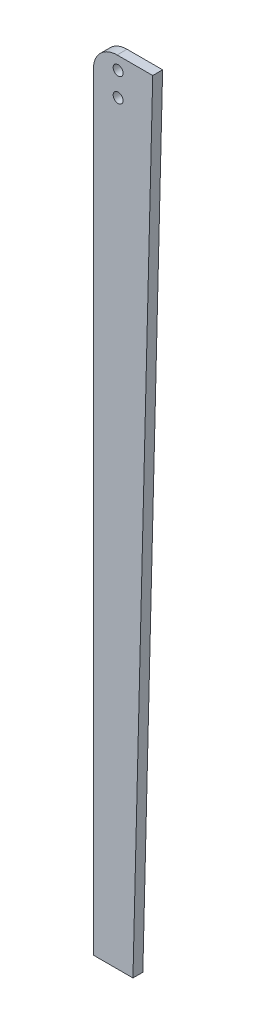
ISO-10303-21;
HEADER;
FILE_DESCRIPTION(('STEP AP214'),'2;1');
FILE_NAME('part.step','',(''),(''),'','','');
FILE_SCHEMA(('AUTOMOTIVE_DESIGN { 1 0 10303 214 1 1 1 1 }'));
ENDSEC;
DATA;
#1=APPLICATION_CONTEXT('core data for automotive mechanical design processes');
#2=APPLICATION_PROTOCOL_DEFINITION('international standard','automotive_design',2000,#1);
#3=PRODUCT_CONTEXT('',#1,'mechanical');
#4=PRODUCT('Part','Part','',(#3));
#5=PRODUCT_RELATED_PRODUCT_CATEGORY('part','',(#4));
#6=PRODUCT_DEFINITION_FORMATION('','',#4);
#7=PRODUCT_DEFINITION_CONTEXT('part definition',#1,'design');
#8=PRODUCT_DEFINITION('design','',#6,#7);
#9=PRODUCT_DEFINITION_SHAPE('','',#8);
#10=(LENGTH_UNIT() NAMED_UNIT(*) SI_UNIT(.MILLI.,.METRE.));
#11=(NAMED_UNIT(*) PLANE_ANGLE_UNIT() SI_UNIT($,.RADIAN.));
#12=(NAMED_UNIT(*) SI_UNIT($,.STERADIAN.) SOLID_ANGLE_UNIT());
#13=UNCERTAINTY_MEASURE_WITH_UNIT(LENGTH_MEASURE(1.E-05),#10,'distance_accuracy_value','');
#14=(GEOMETRIC_REPRESENTATION_CONTEXT(3) GLOBAL_UNCERTAINTY_ASSIGNED_CONTEXT((#13)) GLOBAL_UNIT_ASSIGNED_CONTEXT((#10,
#11,#12)) REPRESENTATION_CONTEXT('',''));
#15=CARTESIAN_POINT('',(0.,0.,0.));
#16=DIRECTION('',(0.,0.,1.));
#17=DIRECTION('',(1.,0.,0.));
#18=AXIS2_PLACEMENT_3D('',#15,#16,#17);
#19=CARTESIAN_POINT('',(-0.317500000000001,-3.4925,3.175));
#20=DIRECTION('',(0.,0.,1.));
#21=DIRECTION('',(1.,0.,0.));
#22=AXIS2_PLACEMENT_3D('',#19,#20,#21);
#23=PLANE('',#22);
#24=CARTESIAN_POINT('',(0.,0.,3.175));
#25=DIRECTION('',(0.,0.,1.));
#26=DIRECTION('',(1.,0.,0.));
#27=AXIS2_PLACEMENT_3D('',#24,#25,#26);
#28=CIRCLE('',#27,1.5875);
#29=CARTESIAN_POINT('',(1.5875,0.,3.175));
#30=VERTEX_POINT('',#29);
#31=EDGE_CURVE('E109',#30,#30,#28,.T.);
#32=ORIENTED_EDGE('',*,*,#31,.F.);
#33=EDGE_LOOP('',(#32));
#34=FACE_BOUND('',#33,.T.);
#35=DIRECTION('',(0.024992191160203,0.999687646408123,0.));
#36=VECTOR('',#35,1.);
#37=CARTESIAN_POINT('',(11.1125,4.1275,3.175));
#38=LINE('',#37,#36);
#39=CARTESIAN_POINT('',(4.76250000000003,-249.8725,3.175));
#40=VERTEX_POINT('',#39);
#41=CARTESIAN_POINT('',(11.1125,4.1275,3.175));
#42=VERTEX_POINT('',#41);
#43=EDGE_CURVE('E114',#40,#42,#38,.T.);
#44=ORIENTED_EDGE('',*,*,#43,.T.);
#45=DIRECTION('',(-1.,0.,0.));
#46=VECTOR('',#45,1.);
#47=CARTESIAN_POINT('',(-0.317500000000001,4.1275,3.175));
#48=LINE('',#47,#46);
#49=CARTESIAN_POINT('',(-0.317500000000002,4.1275,3.175));
#50=VERTEX_POINT('',#49);
#51=EDGE_CURVE('E81',#42,#50,#48,.T.);
#52=ORIENTED_EDGE('',*,*,#51,.T.);
#53=CARTESIAN_POINT('',(-0.317500000000001,-3.4925,3.175));
#54=DIRECTION('',(0.,0.,1.));
#55=DIRECTION('',(1.,0.,0.));
#56=AXIS2_PLACEMENT_3D('',#53,#54,#55);
#57=CIRCLE('',#56,7.62);
#58=CARTESIAN_POINT('',(-7.9375,-3.4925,3.175));
#59=VERTEX_POINT('',#58);
#60=EDGE_CURVE('E85',#50,#59,#57,.T.);
#61=ORIENTED_EDGE('',*,*,#60,.T.);
#62=DIRECTION('',(0.,-1.,0.));
#63=VECTOR('',#62,1.);
#64=CARTESIAN_POINT('',(-7.9375,-3.4925,3.175));
#65=LINE('',#64,#63);
#66=CARTESIAN_POINT('',(-7.93749999999997,-249.8725,3.175));
#67=VERTEX_POINT('',#66);
#68=EDGE_CURVE('E89',#59,#67,#65,.T.);
#69=ORIENTED_EDGE('',*,*,#68,.T.);
#70=DIRECTION('',(1.,0.,0.));
#71=VECTOR('',#70,1.);
#72=CARTESIAN_POINT('',(-7.93749999999997,-249.8725,3.175));
#73=LINE('',#72,#71);
#74=EDGE_CURVE('E47',#67,#40,#73,.T.);
#75=ORIENTED_EDGE('',*,*,#74,.T.);
#76=EDGE_LOOP('',(#44,#52,#61,#69,#75));
#77=FACE_BOUND('',#76,.T.);
#78=CARTESIAN_POINT('',(0.,-7.62,3.175));
#79=DIRECTION('',(0.,0.,1.));
#80=DIRECTION('',(1.,0.,0.));
#81=AXIS2_PLACEMENT_3D('',#78,#79,#80);
#82=CIRCLE('',#81,1.5875);
#83=CARTESIAN_POINT('',(1.5875,-7.62,3.175));
#84=VERTEX_POINT('',#83);
#85=EDGE_CURVE('E152',#84,#84,#82,.T.);
#86=ORIENTED_EDGE('',*,*,#85,.F.);
#87=EDGE_LOOP('',(#86));
#88=FACE_BOUND('',#87,.T.);
#89=ADVANCED_FACE('F30',(#34,#77,#88),#23,.T.);
#90=CARTESIAN_POINT('',(-0.317500000000001,-3.4925,0.));
#91=DIRECTION('',(0.,0.,1.));
#92=DIRECTION('',(1.,0.,0.));
#93=AXIS2_PLACEMENT_3D('',#90,#91,#92);
#94=PLANE('',#93);
#95=CARTESIAN_POINT('',(0.,0.,0.));
#96=DIRECTION('',(0.,0.,1.));
#97=DIRECTION('',(1.,0.,0.));
#98=AXIS2_PLACEMENT_3D('',#95,#96,#97);
#99=CIRCLE('',#98,1.5875);
#100=CARTESIAN_POINT('',(1.5875,0.,0.));
#101=VERTEX_POINT('',#100);
#102=EDGE_CURVE('E157',#101,#101,#99,.T.);
#103=ORIENTED_EDGE('',*,*,#102,.T.);
#104=EDGE_LOOP('',(#103));
#105=FACE_BOUND('',#104,.T.);
#106=DIRECTION('',(0.024992191160203,0.999687646408123,0.));
#107=VECTOR('',#106,1.);
#108=CARTESIAN_POINT('',(11.1125,4.1275,0.));
#109=LINE('',#108,#107);
#110=CARTESIAN_POINT('',(4.76250000000003,-249.8725,0.));
#111=VERTEX_POINT('',#110);
#112=CARTESIAN_POINT('',(11.1125,4.1275,0.));
#113=VERTEX_POINT('',#112);
#114=EDGE_CURVE('E105',#111,#113,#109,.T.);
#115=ORIENTED_EDGE('',*,*,#114,.F.);
#116=DIRECTION('',(1.,0.,0.));
#117=VECTOR('',#116,1.);
#118=CARTESIAN_POINT('',(-7.93749999999997,-249.8725,0.));
#119=LINE('',#118,#117);
#120=CARTESIAN_POINT('',(-7.93749999999997,-249.8725,0.));
#121=VERTEX_POINT('',#120);
#122=EDGE_CURVE('E73',#121,#111,#119,.T.);
#123=ORIENTED_EDGE('',*,*,#122,.F.);
#124=DIRECTION('',(0.,-1.,0.));
#125=VECTOR('',#124,1.);
#126=CARTESIAN_POINT('',(-7.9375,-3.4925,0.));
#127=LINE('',#126,#125);
#128=CARTESIAN_POINT('',(-7.9375,-3.4925,0.));
#129=VERTEX_POINT('',#128);
#130=EDGE_CURVE('E67',#129,#121,#127,.T.);
#131=ORIENTED_EDGE('',*,*,#130,.F.);
#132=CARTESIAN_POINT('',(-0.317500000000001,-3.4925,0.));
#133=DIRECTION('',(0.,0.,1.));
#134=DIRECTION('',(1.,0.,0.));
#135=AXIS2_PLACEMENT_3D('',#132,#133,#134);
#136=CIRCLE('',#135,7.62);
#137=CARTESIAN_POINT('',(-0.317500000000002,4.1275,0.));
#138=VERTEX_POINT('',#137);
#139=EDGE_CURVE('E96',#138,#129,#136,.T.);
#140=ORIENTED_EDGE('',*,*,#139,.F.);
#141=DIRECTION('',(-1.,0.,0.));
#142=VECTOR('',#141,1.);
#143=CARTESIAN_POINT('',(-0.317500000000001,4.1275,0.));
#144=LINE('',#143,#142);
#145=EDGE_CURVE('E108',#113,#138,#144,.T.);
#146=ORIENTED_EDGE('',*,*,#145,.F.);
#147=EDGE_LOOP('',(#115,#123,#131,#140,#146));
#148=FACE_BOUND('',#147,.T.);
#149=CARTESIAN_POINT('',(0.,-7.62,0.));
#150=DIRECTION('',(0.,0.,1.));
#151=DIRECTION('',(1.,0.,0.));
#152=AXIS2_PLACEMENT_3D('',#149,#150,#151);
#153=CIRCLE('',#152,1.5875);
#154=CARTESIAN_POINT('',(1.5875,-7.62,0.));
#155=VERTEX_POINT('',#154);
#156=EDGE_CURVE('E155',#155,#155,#153,.T.);
#157=ORIENTED_EDGE('',*,*,#156,.T.);
#158=EDGE_LOOP('',(#157));
#159=FACE_BOUND('',#158,.T.);
#160=ADVANCED_FACE('F118',(#105,#148,#159),#94,.F.);
#161=CARTESIAN_POINT('',(11.1125,4.1275,3.175));
#162=DIRECTION('',(-0.999687646408123,0.024992191160203,0.));
#163=DIRECTION('',(-0.024992191160203,-0.999687646408123,0.));
#164=AXIS2_PLACEMENT_3D('',#161,#162,#163);
#165=PLANE('',#164);
#166=ORIENTED_EDGE('',*,*,#114,.T.);
#167=DIRECTION('',(0.,0.,-1.));
#168=VECTOR('',#167,1.);
#169=CARTESIAN_POINT('',(11.1125,4.1275,3.175));
#170=LINE('',#169,#168);
#171=EDGE_CURVE('E11',#42,#113,#170,.T.);
#172=ORIENTED_EDGE('',*,*,#171,.F.);
#173=ORIENTED_EDGE('',*,*,#43,.F.);
#174=DIRECTION('',(0.,0.,-1.));
#175=VECTOR('',#174,1.);
#176=CARTESIAN_POINT('',(4.76250000000003,-249.8725,3.175));
#177=LINE('',#176,#175);
#178=EDGE_CURVE('E101',#40,#111,#177,.T.);
#179=ORIENTED_EDGE('',*,*,#178,.T.);
#180=EDGE_LOOP('',(#166,#172,#173,#179));
#181=FACE_BOUND('',#180,.T.);
#182=ADVANCED_FACE('F32',(#181),#165,.F.);
#183=CARTESIAN_POINT('',(-0.317500000000001,4.1275,3.175));
#184=DIRECTION('',(0.,-1.,0.));
#185=DIRECTION('',(0.,0.,-1.));
#186=AXIS2_PLACEMENT_3D('',#183,#184,#185);
#187=PLANE('',#186);
#188=ORIENTED_EDGE('',*,*,#145,.T.);
#189=DIRECTION('',(0.,0.,-1.));
#190=VECTOR('',#189,1.);
#191=CARTESIAN_POINT('',(-0.317500000000002,4.1275,3.175));
#192=LINE('',#191,#190);
#193=EDGE_CURVE('E39',#50,#138,#192,.T.);
#194=ORIENTED_EDGE('',*,*,#193,.F.);
#195=ORIENTED_EDGE('',*,*,#51,.F.);
#196=ORIENTED_EDGE('',*,*,#171,.T.);
#197=EDGE_LOOP('',(#188,#194,#195,#196));
#198=FACE_BOUND('',#197,.T.);
#199=ADVANCED_FACE('F189',(#198),#187,.F.);
#200=CARTESIAN_POINT('',(-0.317500000000001,-3.4925,3.175));
#201=DIRECTION('',(0.,0.,-1.));
#202=DIRECTION('',(-1.,0.,0.));
#203=AXIS2_PLACEMENT_3D('',#200,#201,#202);
#204=CYLINDRICAL_SURFACE('',#203,7.62);
#205=ORIENTED_EDGE('',*,*,#139,.T.);
#206=DIRECTION('',(0.,0.,-1.));
#207=VECTOR('',#206,1.);
#208=CARTESIAN_POINT('',(-7.9375,-3.4925,3.175));
#209=LINE('',#208,#207);
#210=EDGE_CURVE('E93',#59,#129,#209,.T.);
#211=ORIENTED_EDGE('',*,*,#210,.F.);
#212=ORIENTED_EDGE('',*,*,#60,.F.);
#213=ORIENTED_EDGE('',*,*,#193,.T.);
#214=EDGE_LOOP('',(#205,#211,#212,#213));
#215=FACE_BOUND('',#214,.T.);
#216=ADVANCED_FACE('F94',(#215),#204,.T.);
#217=CARTESIAN_POINT('',(-7.9375,-3.4925,3.175));
#218=DIRECTION('',(1.,0.,0.));
#219=DIRECTION('',(0.,1.,0.));
#220=AXIS2_PLACEMENT_3D('',#217,#218,#219);
#221=PLANE('',#220);
#222=ORIENTED_EDGE('',*,*,#130,.T.);
#223=DIRECTION('',(0.,0.,-1.));
#224=VECTOR('',#223,1.);
#225=CARTESIAN_POINT('',(-7.93749999999997,-249.8725,3.175));
#226=LINE('',#225,#224);
#227=EDGE_CURVE('E97',#67,#121,#226,.T.);
#228=ORIENTED_EDGE('',*,*,#227,.F.);
#229=ORIENTED_EDGE('',*,*,#68,.F.);
#230=ORIENTED_EDGE('',*,*,#210,.T.);
#231=EDGE_LOOP('',(#222,#228,#229,#230));
#232=FACE_BOUND('',#231,.T.);
#233=ADVANCED_FACE('F99',(#232),#221,.F.);
#234=CARTESIAN_POINT('',(-7.93749999999997,-249.8725,3.175));
#235=DIRECTION('',(0.,1.,0.));
#236=DIRECTION('',(0.,0.,1.));
#237=AXIS2_PLACEMENT_3D('',#234,#235,#236);
#238=PLANE('',#237);
#239=ORIENTED_EDGE('',*,*,#122,.T.);
#240=ORIENTED_EDGE('',*,*,#178,.F.);
#241=ORIENTED_EDGE('',*,*,#74,.F.);
#242=ORIENTED_EDGE('',*,*,#227,.T.);
#243=EDGE_LOOP('',(#239,#240,#241,#242));
#244=FACE_BOUND('',#243,.T.);
#245=ADVANCED_FACE('F123',(#244),#238,.F.);
#246=CARTESIAN_POINT('',(0.,0.,3.175));
#247=DIRECTION('',(0.,0.,-1.));
#248=DIRECTION('',(-1.,0.,0.));
#249=AXIS2_PLACEMENT_3D('',#246,#247,#248);
#250=CYLINDRICAL_SURFACE('',#249,1.5875);
#251=ORIENTED_EDGE('',*,*,#31,.T.);
#252=EDGE_LOOP('',(#251));
#253=FACE_BOUND('',#252,.T.);
#254=ORIENTED_EDGE('',*,*,#102,.F.);
#255=EDGE_LOOP('',(#254));
#256=FACE_BOUND('',#255,.T.);
#257=ADVANCED_FACE('F125',(#253,#256),#250,.F.);
#258=CARTESIAN_POINT('',(0.,-7.62,3.175));
#259=DIRECTION('',(0.,0.,-1.));
#260=DIRECTION('',(-1.,0.,0.));
#261=AXIS2_PLACEMENT_3D('',#258,#259,#260);
#262=CYLINDRICAL_SURFACE('',#261,1.5875);
#263=ORIENTED_EDGE('',*,*,#85,.T.);
#264=EDGE_LOOP('',(#263));
#265=FACE_BOUND('',#264,.T.);
#266=ORIENTED_EDGE('',*,*,#156,.F.);
#267=EDGE_LOOP('',(#266));
#268=FACE_BOUND('',#267,.T.);
#269=ADVANCED_FACE('F131',(#265,#268),#262,.F.);
#270=CLOSED_SHELL('',(#89,#160,#182,#199,#216,#233,#245,#257,#269));
#271=MANIFOLD_SOLID_BREP('B2',#270);
#272=ADVANCED_BREP_SHAPE_REPRESENTATION('',(#18,#271),#14);
#273=SHAPE_DEFINITION_REPRESENTATION(#9,#272);
ENDSEC;
END-ISO-10303-21;
